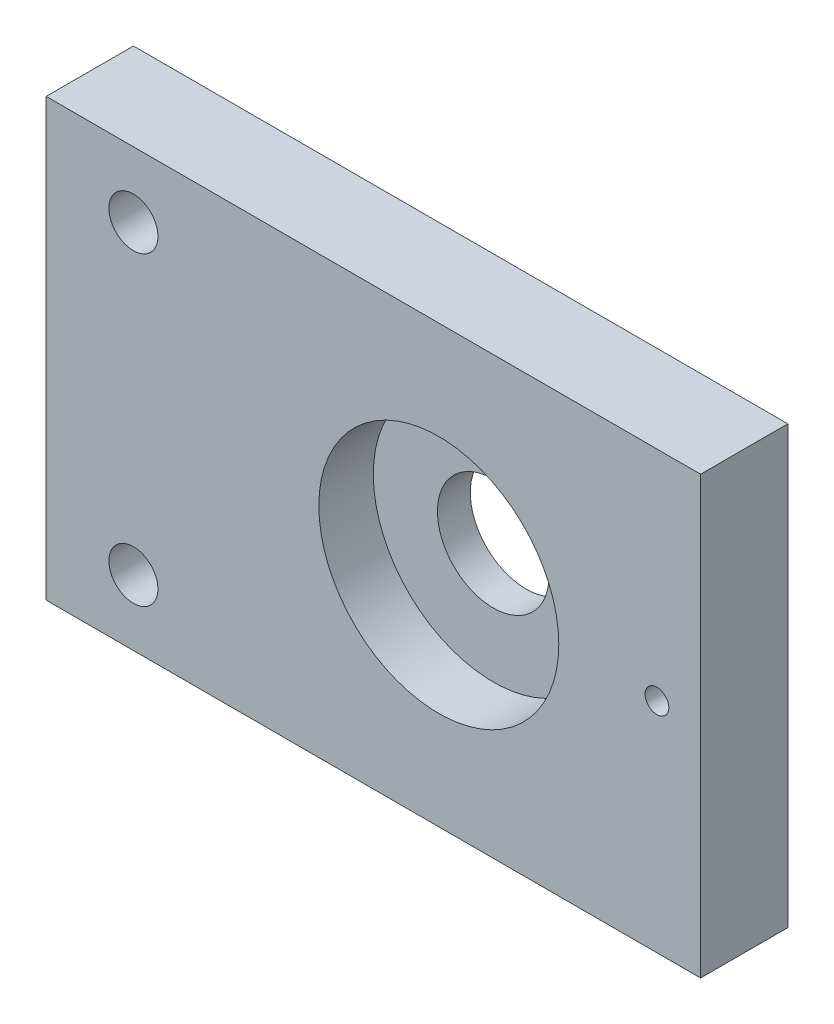
ISO-10303-21;
HEADER;
FILE_DESCRIPTION(('STEP AP214'),'2;1');
FILE_NAME('part.step','',(''),(''),'','','');
FILE_SCHEMA(('AUTOMOTIVE_DESIGN { 1 0 10303 214 1 1 1 1 }'));
ENDSEC;
DATA;
#1=APPLICATION_CONTEXT('core data for automotive mechanical design processes');
#2=APPLICATION_PROTOCOL_DEFINITION('international standard','automotive_design',2000,#1);
#3=PRODUCT_CONTEXT('',#1,'mechanical');
#4=PRODUCT('Part','Part','',(#3));
#5=PRODUCT_RELATED_PRODUCT_CATEGORY('part','',(#4));
#6=PRODUCT_DEFINITION_FORMATION('','',#4);
#7=PRODUCT_DEFINITION_CONTEXT('part definition',#1,'design');
#8=PRODUCT_DEFINITION('design','',#6,#7);
#9=PRODUCT_DEFINITION_SHAPE('','',#8);
#10=(LENGTH_UNIT() NAMED_UNIT(*) SI_UNIT(.MILLI.,.METRE.));
#11=(NAMED_UNIT(*) PLANE_ANGLE_UNIT() SI_UNIT($,.RADIAN.));
#12=(NAMED_UNIT(*) SI_UNIT($,.STERADIAN.) SOLID_ANGLE_UNIT());
#13=UNCERTAINTY_MEASURE_WITH_UNIT(LENGTH_MEASURE(1.E-05),#10,'distance_accuracy_value','');
#14=(GEOMETRIC_REPRESENTATION_CONTEXT(3) GLOBAL_UNCERTAINTY_ASSIGNED_CONTEXT((#13)) GLOBAL_UNIT_ASSIGNED_CONTEXT((#10,
#11,#12)) REPRESENTATION_CONTEXT('',''));
#15=CARTESIAN_POINT('',(0.,0.,0.));
#16=DIRECTION('',(0.,0.,1.));
#17=DIRECTION('',(1.,0.,0.));
#18=AXIS2_PLACEMENT_3D('',#15,#16,#17);
#19=CARTESIAN_POINT('',(0.,0.,12.7));
#20=DIRECTION('',(1.,0.,0.));
#21=DIRECTION('',(0.,0.,-1.));
#22=AXIS2_PLACEMENT_3D('',#19,#20,#21);
#23=PLANE('',#22);
#24=DIRECTION('',(0.,-1.,0.));
#25=VECTOR('',#24,1.);
#26=CARTESIAN_POINT('',(0.,0.,0.));
#27=LINE('',#26,#25);
#28=CARTESIAN_POINT('',(0.,63.5,0.));
#29=VERTEX_POINT('',#28);
#30=CARTESIAN_POINT('',(0.,0.,0.));
#31=VERTEX_POINT('',#30);
#32=EDGE_CURVE('E97',#29,#31,#27,.T.);
#33=ORIENTED_EDGE('',*,*,#32,.T.);
#34=DIRECTION('',(0.,0.,-1.));
#35=VECTOR('',#34,1.);
#36=CARTESIAN_POINT('',(0.,0.,12.7));
#37=LINE('',#36,#35);
#38=CARTESIAN_POINT('',(0.,0.,12.7));
#39=VERTEX_POINT('',#38);
#40=EDGE_CURVE('E11',#39,#31,#37,.T.);
#41=ORIENTED_EDGE('',*,*,#40,.F.);
#42=DIRECTION('',(0.,-1.,0.));
#43=VECTOR('',#42,1.);
#44=CARTESIAN_POINT('',(0.,0.,12.7));
#45=LINE('',#44,#43);
#46=CARTESIAN_POINT('',(0.,63.5,12.7));
#47=VERTEX_POINT('',#46);
#48=EDGE_CURVE('E85',#47,#39,#45,.T.);
#49=ORIENTED_EDGE('',*,*,#48,.F.);
#50=DIRECTION('',(0.,0.,-1.));
#51=VECTOR('',#50,1.);
#52=CARTESIAN_POINT('',(0.,63.5,12.7));
#53=LINE('',#52,#51);
#54=EDGE_CURVE('E93',#47,#29,#53,.T.);
#55=ORIENTED_EDGE('',*,*,#54,.T.);
#56=EDGE_LOOP('',(#33,#41,#49,#55));
#57=FACE_BOUND('',#56,.T.);
#58=ADVANCED_FACE('F34',(#57),#23,.F.);
#59=CARTESIAN_POINT('',(0.,0.,12.7));
#60=DIRECTION('',(0.,1.,0.));
#61=DIRECTION('',(0.,0.,1.));
#62=AXIS2_PLACEMENT_3D('',#59,#60,#61);
#63=PLANE('',#62);
#64=DIRECTION('',(1.,0.,0.));
#65=VECTOR('',#64,1.);
#66=CARTESIAN_POINT('',(0.,0.,0.));
#67=LINE('',#66,#65);
#68=CARTESIAN_POINT('',(95.25,0.,0.));
#69=VERTEX_POINT('',#68);
#70=EDGE_CURVE('E89',#31,#69,#67,.T.);
#71=ORIENTED_EDGE('',*,*,#70,.T.);
#72=DIRECTION('',(0.,0.,-1.));
#73=VECTOR('',#72,1.);
#74=CARTESIAN_POINT('',(95.25,0.,12.7));
#75=LINE('',#74,#73);
#76=CARTESIAN_POINT('',(95.25,0.,12.7));
#77=VERTEX_POINT('',#76);
#78=EDGE_CURVE('E42',#77,#69,#75,.T.);
#79=ORIENTED_EDGE('',*,*,#78,.F.);
#80=DIRECTION('',(1.,0.,0.));
#81=VECTOR('',#80,1.);
#82=CARTESIAN_POINT('',(0.,0.,12.7));
#83=LINE('',#82,#81);
#84=EDGE_CURVE('E80',#39,#77,#83,.T.);
#85=ORIENTED_EDGE('',*,*,#84,.F.);
#86=ORIENTED_EDGE('',*,*,#40,.T.);
#87=EDGE_LOOP('',(#71,#79,#85,#86));
#88=FACE_BOUND('',#87,.T.);
#89=ADVANCED_FACE('F88',(#88),#63,.F.);
#90=CARTESIAN_POINT('',(95.25,0.,12.7));
#91=DIRECTION('',(-1.,0.,0.));
#92=DIRECTION('',(0.,0.,1.));
#93=AXIS2_PLACEMENT_3D('',#90,#91,#92);
#94=PLANE('',#93);
#95=DIRECTION('',(0.,1.,0.));
#96=VECTOR('',#95,1.);
#97=CARTESIAN_POINT('',(95.25,0.,0.));
#98=LINE('',#97,#96);
#99=CARTESIAN_POINT('',(95.25,63.5,0.));
#100=VERTEX_POINT('',#99);
#101=EDGE_CURVE('E67',#69,#100,#98,.T.);
#102=ORIENTED_EDGE('',*,*,#101,.T.);
#103=DIRECTION('',(0.,0.,-1.));
#104=VECTOR('',#103,1.);
#105=CARTESIAN_POINT('',(95.25,63.5,12.7));
#106=LINE('',#105,#104);
#107=CARTESIAN_POINT('',(95.25,63.5,12.7));
#108=VERTEX_POINT('',#107);
#109=EDGE_CURVE('E90',#108,#100,#106,.T.);
#110=ORIENTED_EDGE('',*,*,#109,.F.);
#111=DIRECTION('',(0.,1.,0.));
#112=VECTOR('',#111,1.);
#113=CARTESIAN_POINT('',(95.25,0.,12.7));
#114=LINE('',#113,#112);
#115=EDGE_CURVE('E83',#77,#108,#114,.T.);
#116=ORIENTED_EDGE('',*,*,#115,.F.);
#117=ORIENTED_EDGE('',*,*,#78,.T.);
#118=EDGE_LOOP('',(#102,#110,#116,#117));
#119=FACE_BOUND('',#118,.T.);
#120=ADVANCED_FACE('F91',(#119),#94,.F.);
#121=CARTESIAN_POINT('',(0.,63.5,12.7));
#122=DIRECTION('',(0.,-1.,0.));
#123=DIRECTION('',(0.,0.,-1.));
#124=AXIS2_PLACEMENT_3D('',#121,#122,#123);
#125=PLANE('',#124);
#126=DIRECTION('',(-1.,0.,0.));
#127=VECTOR('',#126,1.);
#128=CARTESIAN_POINT('',(0.,63.5,0.));
#129=LINE('',#128,#127);
#130=EDGE_CURVE('E73',#100,#29,#129,.T.);
#131=ORIENTED_EDGE('',*,*,#130,.T.);
#132=ORIENTED_EDGE('',*,*,#54,.F.);
#133=DIRECTION('',(-1.,0.,0.));
#134=VECTOR('',#133,1.);
#135=CARTESIAN_POINT('',(0.,63.5,12.7));
#136=LINE('',#135,#134);
#137=EDGE_CURVE('E50',#108,#47,#136,.T.);
#138=ORIENTED_EDGE('',*,*,#137,.F.);
#139=ORIENTED_EDGE('',*,*,#109,.T.);
#140=EDGE_LOOP('',(#131,#132,#138,#139));
#141=FACE_BOUND('',#140,.T.);
#142=ADVANCED_FACE('F105',(#141),#125,.F.);
#143=CARTESIAN_POINT('',(0.,63.5,12.7));
#144=DIRECTION('',(0.,0.,-1.));
#145=DIRECTION('',(-1.,0.,0.));
#146=AXIS2_PLACEMENT_3D('',#143,#144,#145);
#147=PLANE('',#146);
#148=CARTESIAN_POINT('',(88.9,31.75,12.7));
#149=DIRECTION('',(0.,0.,1.));
#150=DIRECTION('',(1.,0.,0.));
#151=AXIS2_PLACEMENT_3D('',#148,#149,#150);
#152=CIRCLE('',#151,1.72719999999998);
#153=CARTESIAN_POINT('',(90.6272,31.75,12.7));
#154=VERTEX_POINT('',#153);
#155=EDGE_CURVE('E149',#154,#154,#152,.T.);
#156=ORIENTED_EDGE('',*,*,#155,.F.);
#157=EDGE_LOOP('',(#156));
#158=FACE_BOUND('',#157,.T.);
#159=CARTESIAN_POINT('',(57.15,31.75,12.7));
#160=DIRECTION('',(0.,0.,1.));
#161=DIRECTION('',(1.,0.,0.));
#162=AXIS2_PLACEMENT_3D('',#159,#160,#161);
#163=CIRCLE('',#162,17.4625);
#164=CARTESIAN_POINT('',(74.6125,31.75,12.7));
#165=VERTEX_POINT('',#164);
#166=EDGE_CURVE('E143',#165,#165,#163,.T.);
#167=ORIENTED_EDGE('',*,*,#166,.F.);
#168=EDGE_LOOP('',(#167));
#169=FACE_BOUND('',#168,.T.);
#170=CARTESIAN_POINT('',(12.7,53.975,12.7));
#171=DIRECTION('',(0.,0.,-1.));
#172=DIRECTION('',(-1.,0.,0.));
#173=AXIS2_PLACEMENT_3D('',#170,#171,#172);
#174=CIRCLE('',#173,3.57123999999999);
#175=CARTESIAN_POINT('',(9.12876000000001,53.975,12.7));
#176=VERTEX_POINT('',#175);
#177=EDGE_CURVE('E122',#176,#176,#174,.T.);
#178=ORIENTED_EDGE('',*,*,#177,.T.);
#179=EDGE_LOOP('',(#178));
#180=FACE_BOUND('',#179,.T.);
#181=CARTESIAN_POINT('',(12.7,9.525,12.7));
#182=DIRECTION('',(0.,0.,-1.));
#183=DIRECTION('',(-1.,0.,0.));
#184=AXIS2_PLACEMENT_3D('',#181,#182,#183);
#185=CIRCLE('',#184,3.57124);
#186=CARTESIAN_POINT('',(9.12876,9.525,12.7));
#187=VERTEX_POINT('',#186);
#188=EDGE_CURVE('E100',#187,#187,#185,.T.);
#189=ORIENTED_EDGE('',*,*,#188,.T.);
#190=EDGE_LOOP('',(#189));
#191=FACE_BOUND('',#190,.T.);
#192=ORIENTED_EDGE('',*,*,#48,.T.);
#193=ORIENTED_EDGE('',*,*,#84,.T.);
#194=ORIENTED_EDGE('',*,*,#115,.T.);
#195=ORIENTED_EDGE('',*,*,#137,.T.);
#196=EDGE_LOOP('',(#192,#193,#194,#195));
#197=FACE_BOUND('',#196,.T.);
#198=ADVANCED_FACE('F81',(#158,#169,#180,#191,#197),#147,.F.);
#199=CARTESIAN_POINT('',(0.,63.5,0.));
#200=DIRECTION('',(0.,0.,-1.));
#201=DIRECTION('',(-1.,0.,0.));
#202=AXIS2_PLACEMENT_3D('',#199,#200,#201);
#203=PLANE('',#202);
#204=CARTESIAN_POINT('',(88.9,31.75,0.));
#205=DIRECTION('',(0.,0.,1.));
#206=DIRECTION('',(1.,0.,0.));
#207=AXIS2_PLACEMENT_3D('',#204,#205,#206);
#208=CIRCLE('',#207,1.7272);
#209=CARTESIAN_POINT('',(90.6272,31.75,0.));
#210=VERTEX_POINT('',#209);
#211=EDGE_CURVE('E146',#210,#210,#208,.T.);
#212=ORIENTED_EDGE('',*,*,#211,.T.);
#213=EDGE_LOOP('',(#212));
#214=FACE_BOUND('',#213,.T.);
#215=CARTESIAN_POINT('',(57.15,31.75,0.));
#216=DIRECTION('',(0.,0.,1.));
#217=DIRECTION('',(1.,0.,0.));
#218=AXIS2_PLACEMENT_3D('',#215,#216,#217);
#219=CIRCLE('',#218,8.128);
#220=CARTESIAN_POINT('',(65.278,31.75,0.));
#221=VERTEX_POINT('',#220);
#222=EDGE_CURVE('E134',#221,#221,#219,.T.);
#223=ORIENTED_EDGE('',*,*,#222,.T.);
#224=EDGE_LOOP('',(#223));
#225=FACE_BOUND('',#224,.T.);
#226=CARTESIAN_POINT('',(12.7,53.975,0.));
#227=DIRECTION('',(0.,0.,-1.));
#228=DIRECTION('',(-1.,0.,0.));
#229=AXIS2_PLACEMENT_3D('',#226,#227,#228);
#230=CIRCLE('',#229,5.55625);
#231=CARTESIAN_POINT('',(7.14375000000001,53.975,0.));
#232=VERTEX_POINT('',#231);
#233=EDGE_CURVE('E131',#232,#232,#230,.T.);
#234=ORIENTED_EDGE('',*,*,#233,.F.);
#235=EDGE_LOOP('',(#234));
#236=FACE_BOUND('',#235,.T.);
#237=CARTESIAN_POINT('',(12.7,9.525,0.));
#238=DIRECTION('',(0.,0.,-1.));
#239=DIRECTION('',(-1.,0.,0.));
#240=AXIS2_PLACEMENT_3D('',#237,#238,#239);
#241=CIRCLE('',#240,5.55625);
#242=CARTESIAN_POINT('',(7.14375,9.525,0.));
#243=VERTEX_POINT('',#242);
#244=EDGE_CURVE('E119',#243,#243,#241,.T.);
#245=ORIENTED_EDGE('',*,*,#244,.F.);
#246=EDGE_LOOP('',(#245));
#247=FACE_BOUND('',#246,.T.);
#248=ORIENTED_EDGE('',*,*,#32,.F.);
#249=ORIENTED_EDGE('',*,*,#130,.F.);
#250=ORIENTED_EDGE('',*,*,#101,.F.);
#251=ORIENTED_EDGE('',*,*,#70,.F.);
#252=EDGE_LOOP('',(#248,#249,#250,#251));
#253=FACE_BOUND('',#252,.T.);
#254=ADVANCED_FACE('F108',(#214,#225,#236,#247,#253),#203,.T.);
#255=CARTESIAN_POINT('',(12.7,9.525,0.));
#256=DIRECTION('',(0.,0.,-1.));
#257=DIRECTION('',(-1.,0.,0.));
#258=AXIS2_PLACEMENT_3D('',#255,#256,#257);
#259=CYLINDRICAL_SURFACE('',#258,3.57124);
#260=ORIENTED_EDGE('',*,*,#188,.F.);
#261=EDGE_LOOP('',(#260));
#262=FACE_BOUND('',#261,.T.);
#263=CARTESIAN_POINT('',(12.7,9.525,6.35));
#264=DIRECTION('',(0.,0.,-1.));
#265=DIRECTION('',(-1.,0.,0.));
#266=AXIS2_PLACEMENT_3D('',#263,#264,#265);
#267=CIRCLE('',#266,3.57124);
#268=CARTESIAN_POINT('',(9.12876,9.525,6.35));
#269=VERTEX_POINT('',#268);
#270=EDGE_CURVE('E113',#269,#269,#267,.T.);
#271=ORIENTED_EDGE('',*,*,#270,.T.);
#272=EDGE_LOOP('',(#271));
#273=FACE_BOUND('',#272,.T.);
#274=ADVANCED_FACE('F164',(#262,#273),#259,.F.);
#275=CARTESIAN_POINT('',(16.27124,9.525,6.35));
#276=DIRECTION('',(0.,0.,1.));
#277=DIRECTION('',(1.,0.,0.));
#278=AXIS2_PLACEMENT_3D('',#275,#276,#277);
#279=PLANE('',#278);
#280=ORIENTED_EDGE('',*,*,#270,.F.);
#281=EDGE_LOOP('',(#280));
#282=FACE_BOUND('',#281,.T.);
#283=CARTESIAN_POINT('',(12.7,9.525,6.35));
#284=DIRECTION('',(0.,0.,-1.));
#285=DIRECTION('',(-1.,0.,0.));
#286=AXIS2_PLACEMENT_3D('',#283,#284,#285);
#287=CIRCLE('',#286,5.55625);
#288=CARTESIAN_POINT('',(7.14375,9.525,6.35));
#289=VERTEX_POINT('',#288);
#290=EDGE_CURVE('E116',#289,#289,#287,.T.);
#291=ORIENTED_EDGE('',*,*,#290,.T.);
#292=EDGE_LOOP('',(#291));
#293=FACE_BOUND('',#292,.T.);
#294=ADVANCED_FACE('F167',(#282,#293),#279,.F.);
#295=CARTESIAN_POINT('',(12.7,9.525,0.));
#296=DIRECTION('',(0.,0.,-1.));
#297=DIRECTION('',(-1.,0.,0.));
#298=AXIS2_PLACEMENT_3D('',#295,#296,#297);
#299=CYLINDRICAL_SURFACE('',#298,5.55625);
#300=ORIENTED_EDGE('',*,*,#290,.F.);
#301=EDGE_LOOP('',(#300));
#302=FACE_BOUND('',#301,.T.);
#303=ORIENTED_EDGE('',*,*,#244,.T.);
#304=EDGE_LOOP('',(#303));
#305=FACE_BOUND('',#304,.T.);
#306=ADVANCED_FACE('F173',(#302,#305),#299,.F.);
#307=CARTESIAN_POINT('',(12.7,53.975,0.));
#308=DIRECTION('',(0.,0.,-1.));
#309=DIRECTION('',(-1.,0.,0.));
#310=AXIS2_PLACEMENT_3D('',#307,#308,#309);
#311=CYLINDRICAL_SURFACE('',#310,3.57124);
#312=ORIENTED_EDGE('',*,*,#177,.F.);
#313=EDGE_LOOP('',(#312));
#314=FACE_BOUND('',#313,.T.);
#315=CARTESIAN_POINT('',(12.7,53.975,6.35));
#316=DIRECTION('',(0.,0.,-1.));
#317=DIRECTION('',(-1.,0.,0.));
#318=AXIS2_PLACEMENT_3D('',#315,#316,#317);
#319=CIRCLE('',#318,3.57124);
#320=CARTESIAN_POINT('',(9.12876000000001,53.975,6.35));
#321=VERTEX_POINT('',#320);
#322=EDGE_CURVE('E125',#321,#321,#319,.T.);
#323=ORIENTED_EDGE('',*,*,#322,.T.);
#324=EDGE_LOOP('',(#323));
#325=FACE_BOUND('',#324,.T.);
#326=ADVANCED_FACE('F179',(#314,#325),#311,.F.);
#327=CARTESIAN_POINT('',(16.27124,53.975,6.35));
#328=DIRECTION('',(0.,0.,1.));
#329=DIRECTION('',(1.,0.,0.));
#330=AXIS2_PLACEMENT_3D('',#327,#328,#329);
#331=PLANE('',#330);
#332=ORIENTED_EDGE('',*,*,#322,.F.);
#333=EDGE_LOOP('',(#332));
#334=FACE_BOUND('',#333,.T.);
#335=CARTESIAN_POINT('',(12.7,53.975,6.35));
#336=DIRECTION('',(0.,0.,-1.));
#337=DIRECTION('',(-1.,0.,0.));
#338=AXIS2_PLACEMENT_3D('',#335,#336,#337);
#339=CIRCLE('',#338,5.55625);
#340=CARTESIAN_POINT('',(7.14375000000001,53.975,6.35));
#341=VERTEX_POINT('',#340);
#342=EDGE_CURVE('E128',#341,#341,#339,.T.);
#343=ORIENTED_EDGE('',*,*,#342,.T.);
#344=EDGE_LOOP('',(#343));
#345=FACE_BOUND('',#344,.T.);
#346=ADVANCED_FACE('F255',(#334,#345),#331,.F.);
#347=CARTESIAN_POINT('',(12.7,53.975,0.));
#348=DIRECTION('',(0.,0.,-1.));
#349=DIRECTION('',(-1.,0.,0.));
#350=AXIS2_PLACEMENT_3D('',#347,#348,#349);
#351=CYLINDRICAL_SURFACE('',#350,5.55625);
#352=ORIENTED_EDGE('',*,*,#342,.F.);
#353=EDGE_LOOP('',(#352));
#354=FACE_BOUND('',#353,.T.);
#355=ORIENTED_EDGE('',*,*,#233,.T.);
#356=EDGE_LOOP('',(#355));
#357=FACE_BOUND('',#356,.T.);
#358=ADVANCED_FACE('F247',(#354,#357),#351,.F.);
#359=CARTESIAN_POINT('',(57.15,31.75,12.7));
#360=DIRECTION('',(0.,0.,1.));
#361=DIRECTION('',(1.,0.,0.));
#362=AXIS2_PLACEMENT_3D('',#359,#360,#361);
#363=CYLINDRICAL_SURFACE('',#362,8.128);
#364=ORIENTED_EDGE('',*,*,#222,.F.);
#365=EDGE_LOOP('',(#364));
#366=FACE_BOUND('',#365,.T.);
#367=CARTESIAN_POINT('',(57.15,31.75,4.7752));
#368=DIRECTION('',(0.,0.,1.));
#369=DIRECTION('',(1.,0.,0.));
#370=AXIS2_PLACEMENT_3D('',#367,#368,#369);
#371=CIRCLE('',#370,8.128);
#372=CARTESIAN_POINT('',(65.278,31.75,4.7752));
#373=VERTEX_POINT('',#372);
#374=EDGE_CURVE('E137',#373,#373,#371,.T.);
#375=ORIENTED_EDGE('',*,*,#374,.T.);
#376=EDGE_LOOP('',(#375));
#377=FACE_BOUND('',#376,.T.);
#378=ADVANCED_FACE('F239',(#366,#377),#363,.F.);
#379=CARTESIAN_POINT('',(65.278,31.75,4.7752));
#380=DIRECTION('',(0.,0.,-1.));
#381=DIRECTION('',(-1.,0.,0.));
#382=AXIS2_PLACEMENT_3D('',#379,#380,#381);
#383=PLANE('',#382);
#384=ORIENTED_EDGE('',*,*,#374,.F.);
#385=EDGE_LOOP('',(#384));
#386=FACE_BOUND('',#385,.T.);
#387=CARTESIAN_POINT('',(57.15,31.75,4.7752));
#388=DIRECTION('',(0.,0.,1.));
#389=DIRECTION('',(1.,0.,0.));
#390=AXIS2_PLACEMENT_3D('',#387,#388,#389);
#391=CIRCLE('',#390,17.4625);
#392=CARTESIAN_POINT('',(74.6125,31.75,4.7752));
#393=VERTEX_POINT('',#392);
#394=EDGE_CURVE('E140',#393,#393,#391,.T.);
#395=ORIENTED_EDGE('',*,*,#394,.T.);
#396=EDGE_LOOP('',(#395));
#397=FACE_BOUND('',#396,.T.);
#398=ADVANCED_FACE('F234',(#386,#397),#383,.F.);
#399=CARTESIAN_POINT('',(57.15,31.75,12.7));
#400=DIRECTION('',(0.,0.,1.));
#401=DIRECTION('',(1.,0.,0.));
#402=AXIS2_PLACEMENT_3D('',#399,#400,#401);
#403=CYLINDRICAL_SURFACE('',#402,17.4625);
#404=ORIENTED_EDGE('',*,*,#394,.F.);
#405=EDGE_LOOP('',(#404));
#406=FACE_BOUND('',#405,.T.);
#407=ORIENTED_EDGE('',*,*,#166,.T.);
#408=EDGE_LOOP('',(#407));
#409=FACE_BOUND('',#408,.T.);
#410=ADVANCED_FACE('F214',(#406,#409),#403,.F.);
#411=CARTESIAN_POINT('',(88.9,31.75,12.7));
#412=DIRECTION('',(0.,0.,1.));
#413=DIRECTION('',(1.,0.,0.));
#414=AXIS2_PLACEMENT_3D('',#411,#412,#413);
#415=CYLINDRICAL_SURFACE('',#414,1.72719999999999);
#416=ORIENTED_EDGE('',*,*,#211,.F.);
#417=EDGE_LOOP('',(#416));
#418=FACE_BOUND('',#417,.T.);
#419=ORIENTED_EDGE('',*,*,#155,.T.);
#420=EDGE_LOOP('',(#419));
#421=FACE_BOUND('',#420,.T.);
#422=ADVANCED_FACE('F153',(#418,#421),#415,.F.);
#423=CLOSED_SHELL('',(#58,#89,#120,#142,#198,#254,#274,#294,#306,#326,#346,#358,#378,#398,#410,#422));
#424=MANIFOLD_SOLID_BREP('B2',#423);
#425=ADVANCED_BREP_SHAPE_REPRESENTATION('',(#18,#424),#14);
#426=SHAPE_DEFINITION_REPRESENTATION(#9,#425);
ENDSEC;
END-ISO-10303-21;
